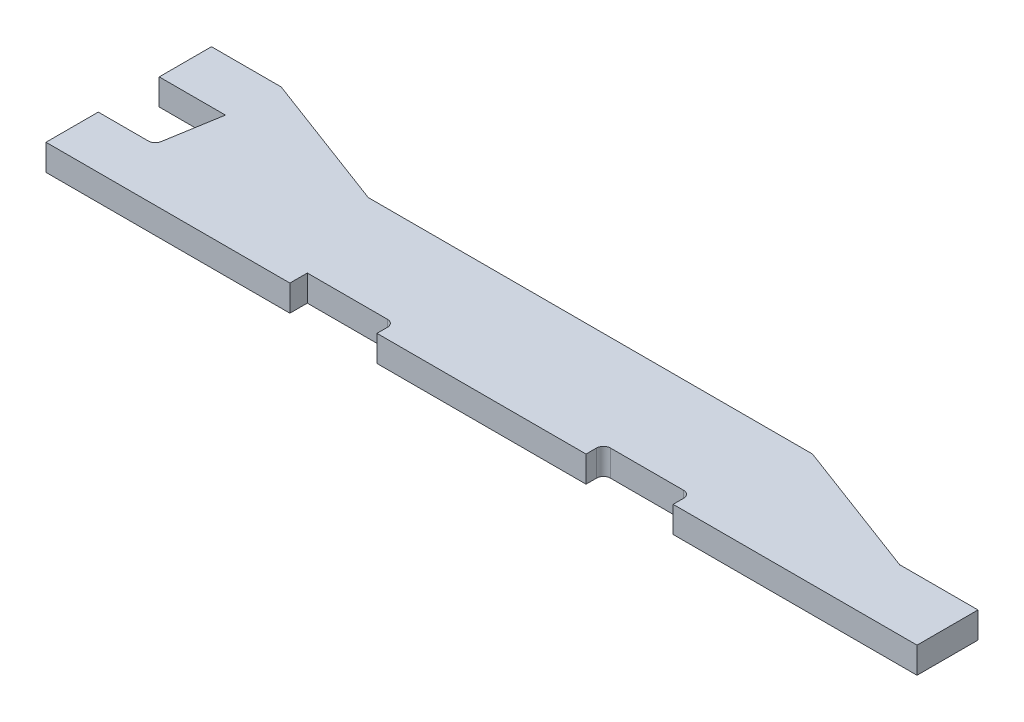
ISO-10303-21;
HEADER;
FILE_DESCRIPTION(('STEP AP214'),'2;1');
FILE_NAME('part.step','',(''),(''),'','','');
FILE_SCHEMA(('AUTOMOTIVE_DESIGN { 1 0 10303 214 1 1 1 1 }'));
ENDSEC;
DATA;
#1=APPLICATION_CONTEXT('core data for automotive mechanical design processes');
#2=APPLICATION_PROTOCOL_DEFINITION('international standard','automotive_design',2000,#1);
#3=PRODUCT_CONTEXT('',#1,'mechanical');
#4=PRODUCT('Part','Part','',(#3));
#5=PRODUCT_RELATED_PRODUCT_CATEGORY('part','',(#4));
#6=PRODUCT_DEFINITION_FORMATION('','',#4);
#7=PRODUCT_DEFINITION_CONTEXT('part definition',#1,'design');
#8=PRODUCT_DEFINITION('design','',#6,#7);
#9=PRODUCT_DEFINITION_SHAPE('','',#8);
#10=(LENGTH_UNIT() NAMED_UNIT(*) SI_UNIT(.MILLI.,.METRE.));
#11=(NAMED_UNIT(*) PLANE_ANGLE_UNIT() SI_UNIT($,.RADIAN.));
#12=(NAMED_UNIT(*) SI_UNIT($,.STERADIAN.) SOLID_ANGLE_UNIT());
#13=UNCERTAINTY_MEASURE_WITH_UNIT(LENGTH_MEASURE(1.E-05),#10,'distance_accuracy_value','');
#14=(GEOMETRIC_REPRESENTATION_CONTEXT(3) GLOBAL_UNCERTAINTY_ASSIGNED_CONTEXT((#13)) GLOBAL_UNIT_ASSIGNED_CONTEXT((#10,
#11,#12)) REPRESENTATION_CONTEXT('',''));
#15=CARTESIAN_POINT('',(0.,0.,0.));
#16=DIRECTION('',(0.,0.,1.));
#17=DIRECTION('',(1.,0.,0.));
#18=AXIS2_PLACEMENT_3D('',#15,#16,#17);
#19=CARTESIAN_POINT('',(-250.,-7.5,0.));
#20=DIRECTION('',(0.,0.,1.));
#21=DIRECTION('',(1.,0.,0.));
#22=AXIS2_PLACEMENT_3D('',#19,#20,#21);
#23=PLANE('',#22);
#24=DIRECTION('',(0.,1.,0.));
#25=VECTOR('',#24,1.);
#26=CARTESIAN_POINT('',(-110.,-7.50005000000005,0.));
#27=LINE('',#26,#25);
#28=CARTESIAN_POINT('',(-110.,-7.5,0.));
#29=VERTEX_POINT('',#28);
#30=CARTESIAN_POINT('',(-110.,7.49999999999999,0.));
#31=VERTEX_POINT('',#30);
#32=EDGE_CURVE('E326',#29,#31,#27,.T.);
#33=ORIENTED_EDGE('',*,*,#32,.T.);
#34=DIRECTION('',(-1.,0.,0.));
#35=VECTOR('',#34,1.);
#36=CARTESIAN_POINT('',(-250.,7.5,0.));
#37=LINE('',#36,#35);
#38=CARTESIAN_POINT('',(-250.,7.5,0.));
#39=VERTEX_POINT('',#38);
#40=EDGE_CURVE('E212',#31,#39,#37,.T.);
#41=ORIENTED_EDGE('',*,*,#40,.T.);
#42=DIRECTION('',(0.,-1.,0.));
#43=VECTOR('',#42,1.);
#44=CARTESIAN_POINT('',(-250.,7.5,0.));
#45=LINE('',#44,#43);
#46=CARTESIAN_POINT('',(-250.,-7.5,0.));
#47=VERTEX_POINT('',#46);
#48=EDGE_CURVE('E242',#39,#47,#45,.T.);
#49=ORIENTED_EDGE('',*,*,#48,.T.);
#50=DIRECTION('',(1.,0.,0.));
#51=VECTOR('',#50,1.);
#52=CARTESIAN_POINT('',(-250.,-7.5,0.));
#53=LINE('',#52,#51);
#54=EDGE_CURVE('E253',#47,#29,#53,.T.);
#55=ORIENTED_EDGE('',*,*,#54,.T.);
#56=EDGE_LOOP('',(#33,#41,#49,#55));
#57=FACE_BOUND('',#56,.T.);
#58=ADVANCED_FACE('F26',(#57),#23,.T.);
#59=DIRECTION('',(0.,1.,0.));
#60=VECTOR('',#59,1.);
#61=CARTESIAN_POINT('',(-60.,-7.50005000000005,0.));
#62=LINE('',#61,#60);
#63=CARTESIAN_POINT('',(-60.,-7.5,0.));
#64=VERTEX_POINT('',#63);
#65=CARTESIAN_POINT('',(-60.,7.49999999999999,0.));
#66=VERTEX_POINT('',#65);
#67=EDGE_CURVE('E185',#64,#66,#62,.T.);
#68=ORIENTED_EDGE('',*,*,#67,.F.);
#69=CARTESIAN_POINT('',(60.,-7.5,0.));
#70=VERTEX_POINT('',#69);
#71=EDGE_CURVE('E255',#64,#70,#53,.T.);
#72=ORIENTED_EDGE('',*,*,#71,.T.);
#73=DIRECTION('',(0.,-1.,0.));
#74=VECTOR('',#73,1.);
#75=CARTESIAN_POINT('',(60.,-7.49999999999996,0.));
#76=LINE('',#75,#74);
#77=CARTESIAN_POINT('',(60.,7.50000000000001,0.));
#78=VERTEX_POINT('',#77);
#79=EDGE_CURVE('E210',#78,#70,#76,.T.);
#80=ORIENTED_EDGE('',*,*,#79,.F.);
#81=EDGE_CURVE('E202',#78,#66,#37,.T.);
#82=ORIENTED_EDGE('',*,*,#81,.T.);
#83=EDGE_LOOP('',(#68,#72,#80,#82));
#84=FACE_BOUND('',#83,.T.);
#85=ADVANCED_FACE('F208',(#84),#23,.T.);
#86=CARTESIAN_POINT('',(-250.,7.5,-65.));
#87=DIRECTION('',(-1.,0.,0.));
#88=DIRECTION('',(0.,0.,1.));
#89=AXIS2_PLACEMENT_3D('',#86,#87,#88);
#90=PLANE('',#89);
#91=DIRECTION('',(0.,1.,0.));
#92=VECTOR('',#91,1.);
#93=CARTESIAN_POINT('',(-250.,-59.162365412358,-30.));
#94=LINE('',#93,#92);
#95=CARTESIAN_POINT('',(-250.,-7.5,-30.));
#96=VERTEX_POINT('',#95);
#97=CARTESIAN_POINT('',(-250.,7.49999999999997,-30.));
#98=VERTEX_POINT('',#97);
#99=EDGE_CURVE('E235',#96,#98,#94,.T.);
#100=ORIENTED_EDGE('',*,*,#99,.F.);
#101=DIRECTION('',(0.,0.,1.));
#102=VECTOR('',#101,1.);
#103=CARTESIAN_POINT('',(-250.,-7.5,-65.));
#104=LINE('',#103,#102);
#105=EDGE_CURVE('E417',#96,#47,#104,.T.);
#106=ORIENTED_EDGE('',*,*,#105,.T.);
#107=ORIENTED_EDGE('',*,*,#48,.F.);
#108=DIRECTION('',(0.,0.,1.));
#109=VECTOR('',#108,1.);
#110=CARTESIAN_POINT('',(-250.,7.5,-65.));
#111=LINE('',#110,#109);
#112=EDGE_CURVE('E282',#98,#39,#111,.T.);
#113=ORIENTED_EDGE('',*,*,#112,.F.);
#114=EDGE_LOOP('',(#100,#106,#107,#113));
#115=FACE_BOUND('',#114,.T.);
#116=ADVANCED_FACE('F422',(#115),#90,.T.);
#117=DIRECTION('',(0.,1.,0.));
#118=VECTOR('',#117,1.);
#119=CARTESIAN_POINT('',(-250.,-59.162365412358,-65.));
#120=LINE('',#119,#118);
#121=CARTESIAN_POINT('',(-250.,-7.5,-65.));
#122=VERTEX_POINT('',#121);
#123=CARTESIAN_POINT('',(-250.,7.49999999999997,-65.));
#124=VERTEX_POINT('',#123);
#125=EDGE_CURVE('E380',#122,#124,#120,.T.);
#126=ORIENTED_EDGE('',*,*,#125,.T.);
#127=CARTESIAN_POINT('',(-250.,7.49999999999997,-95.));
#128=VERTEX_POINT('',#127);
#129=EDGE_CURVE('E285',#128,#124,#111,.T.);
#130=ORIENTED_EDGE('',*,*,#129,.F.);
#131=DIRECTION('',(0.,1.,0.));
#132=VECTOR('',#131,1.);
#133=CARTESIAN_POINT('',(-250.,-131.19316876853,-95.));
#134=LINE('',#133,#132);
#135=CARTESIAN_POINT('',(-250.,-7.50000000000001,-95.));
#136=VERTEX_POINT('',#135);
#137=EDGE_CURVE('E243',#136,#128,#134,.T.);
#138=ORIENTED_EDGE('',*,*,#137,.F.);
#139=EDGE_CURVE('E229',#136,#122,#104,.T.);
#140=ORIENTED_EDGE('',*,*,#139,.T.);
#141=EDGE_LOOP('',(#126,#130,#138,#140));
#142=FACE_BOUND('',#141,.T.);
#143=ADVANCED_FACE('F28',(#142),#90,.T.);
#144=CARTESIAN_POINT('',(-250.,7.5,-65.));
#145=DIRECTION('',(0.,1.,0.));
#146=DIRECTION('',(0.,0.,1.));
#147=AXIS2_PLACEMENT_3D('',#144,#145,#146);
#148=PLANE('',#147);
#149=DIRECTION('',(0.,0.,1.));
#150=VECTOR('',#149,1.);
#151=CARTESIAN_POINT('',(-110.,7.49999999999999,0.));
#152=LINE('',#151,#150);
#153=CARTESIAN_POINT('',(-110.,7.49999999999999,-10.));
#154=VERTEX_POINT('',#153);
#155=EDGE_CURVE('E195',#154,#31,#152,.T.);
#156=ORIENTED_EDGE('',*,*,#155,.F.);
#157=DIRECTION('',(-1.,0.,0.));
#158=VECTOR('',#157,1.);
#159=CARTESIAN_POINT('',(-64.,7.49999999999999,-10.));
#160=LINE('',#159,#158);
#161=CARTESIAN_POINT('',(-64.,7.49999999999999,-10.));
#162=VERTEX_POINT('',#161);
#163=EDGE_CURVE('E616',#162,#154,#160,.T.);
#164=ORIENTED_EDGE('',*,*,#163,.F.);
#165=CARTESIAN_POINT('',(-64.,7.49999999999999,-6.));
#166=DIRECTION('',(0.,1.,0.));
#167=DIRECTION('',(-1.,0.,0.));
#168=AXIS2_PLACEMENT_3D('',#165,#166,#167);
#169=CIRCLE('',#168,4.);
#170=CARTESIAN_POINT('',(-60.,7.49999999999999,-5.99999999999997));
#171=VERTEX_POINT('',#170);
#172=EDGE_CURVE('E205',#171,#162,#169,.T.);
#173=ORIENTED_EDGE('',*,*,#172,.F.);
#174=DIRECTION('',(0.,0.,-1.));
#175=VECTOR('',#174,1.);
#176=CARTESIAN_POINT('',(-60.,7.49999999999999,0.));
#177=LINE('',#176,#175);
#178=EDGE_CURVE('E188',#66,#171,#177,.T.);
#179=ORIENTED_EDGE('',*,*,#178,.F.);
#180=ORIENTED_EDGE('',*,*,#81,.F.);
#181=DIRECTION('',(0.,0.,1.));
#182=VECTOR('',#181,1.);
#183=CARTESIAN_POINT('',(60.,7.50000000000001,0.));
#184=LINE('',#183,#182);
#185=CARTESIAN_POINT('',(60.,7.50000000000001,-5.99999999999997));
#186=VERTEX_POINT('',#185);
#187=EDGE_CURVE('E321',#186,#78,#184,.T.);
#188=ORIENTED_EDGE('',*,*,#187,.F.);
#189=CARTESIAN_POINT('',(64.,7.50000000000001,-6.));
#190=DIRECTION('',(0.,1.,0.));
#191=DIRECTION('',(-1.,0.,0.));
#192=AXIS2_PLACEMENT_3D('',#189,#190,#191);
#193=CIRCLE('',#192,4.);
#194=CARTESIAN_POINT('',(64.,7.50000000000001,-10.));
#195=VERTEX_POINT('',#194);
#196=EDGE_CURVE('E338',#195,#186,#193,.T.);
#197=ORIENTED_EDGE('',*,*,#196,.F.);
#198=DIRECTION('',(-1.,0.,0.));
#199=VECTOR('',#198,1.);
#200=CARTESIAN_POINT('',(64.,7.50000000000001,-10.));
#201=LINE('',#200,#199);
#202=CARTESIAN_POINT('',(106.,7.50000000000001,-10.));
#203=VERTEX_POINT('',#202);
#204=EDGE_CURVE('E335',#203,#195,#201,.T.);
#205=ORIENTED_EDGE('',*,*,#204,.F.);
#206=CARTESIAN_POINT('',(106.,7.50000000000001,-6.00000000000001));
#207=DIRECTION('',(0.,1.,0.));
#208=DIRECTION('',(-1.,0.,0.));
#209=AXIS2_PLACEMENT_3D('',#206,#207,#208);
#210=CIRCLE('',#209,4.);
#211=CARTESIAN_POINT('',(110.,7.50000000000001,-5.99999999999998));
#212=VERTEX_POINT('',#211);
#213=EDGE_CURVE('E328',#212,#203,#210,.T.);
#214=ORIENTED_EDGE('',*,*,#213,.F.);
#215=DIRECTION('',(0.,0.,-1.));
#216=VECTOR('',#215,1.);
#217=CARTESIAN_POINT('',(110.,7.50000000000001,0.));
#218=LINE('',#217,#216);
#219=CARTESIAN_POINT('',(110.,7.50000000000001,0.));
#220=VERTEX_POINT('',#219);
#221=EDGE_CURVE('E325',#220,#212,#218,.T.);
#222=ORIENTED_EDGE('',*,*,#221,.F.);
#223=CARTESIAN_POINT('',(250.,7.5,0.));
#224=VERTEX_POINT('',#223);
#225=EDGE_CURVE('E211',#224,#220,#37,.T.);
#226=ORIENTED_EDGE('',*,*,#225,.F.);
#227=DIRECTION('',(0.,0.,1.));
#228=VECTOR('',#227,1.);
#229=CARTESIAN_POINT('',(250.,7.5,-65.));
#230=LINE('',#229,#228);
#231=CARTESIAN_POINT('',(250.,7.50000000000003,-35.));
#232=VERTEX_POINT('',#231);
#233=EDGE_CURVE('E277',#232,#224,#230,.T.);
#234=ORIENTED_EDGE('',*,*,#233,.F.);
#235=DIRECTION('',(1.,0.,0.));
#236=VECTOR('',#235,1.);
#237=CARTESIAN_POINT('',(250.,7.50000000000003,-35.));
#238=LINE('',#237,#236);
#239=CARTESIAN_POINT('',(205.,7.50000000000002,-35.));
#240=VERTEX_POINT('',#239);
#241=EDGE_CURVE('E350',#240,#232,#238,.T.);
#242=ORIENTED_EDGE('',*,*,#241,.F.);
#243=DIRECTION('',(0.936329177569045,0.,0.351123441588392));
#244=VECTOR('',#243,1.);
#245=CARTESIAN_POINT('',(205.,7.50000000000002,-35.));
#246=LINE('',#245,#244);
#247=CARTESIAN_POINT('',(125.,7.50000000000001,-65.));
#248=VERTEX_POINT('',#247);
#249=EDGE_CURVE('E349',#248,#240,#246,.T.);
#250=ORIENTED_EDGE('',*,*,#249,.F.);
#251=DIRECTION('',(-1.,0.,0.));
#252=VECTOR('',#251,1.);
#253=CARTESIAN_POINT('',(-250.,7.5,-65.));
#254=LINE('',#253,#252);
#255=CARTESIAN_POINT('',(-130.,7.5,-65.));
#256=VERTEX_POINT('',#255);
#257=EDGE_CURVE('E228',#248,#256,#254,.T.);
#258=ORIENTED_EDGE('',*,*,#257,.T.);
#259=DIRECTION('',(-0.936329177569044,0.,-0.351123441588392));
#260=VECTOR('',#259,1.);
#261=CARTESIAN_POINT('',(-210.,7.49999999999998,-95.));
#262=LINE('',#261,#260);
#263=CARTESIAN_POINT('',(-210.,7.49999999999998,-95.));
#264=VERTEX_POINT('',#263);
#265=EDGE_CURVE('E231',#256,#264,#262,.T.);
#266=ORIENTED_EDGE('',*,*,#265,.T.);
#267=DIRECTION('',(-1.,0.,0.));
#268=VECTOR('',#267,1.);
#269=CARTESIAN_POINT('',(-250.,7.49999999999997,-95.));
#270=LINE('',#269,#268);
#271=EDGE_CURVE('E234',#264,#128,#270,.T.);
#272=ORIENTED_EDGE('',*,*,#271,.T.);
#273=ORIENTED_EDGE('',*,*,#129,.T.);
#274=DIRECTION('',(-1.,0.,0.));
#275=VECTOR('',#274,1.);
#276=CARTESIAN_POINT('',(-250.,7.49999999999997,-65.));
#277=LINE('',#276,#275);
#278=CARTESIAN_POINT('',(-212.,7.49999999999998,-65.));
#279=VERTEX_POINT('',#278);
#280=EDGE_CURVE('E363',#279,#124,#277,.T.);
#281=ORIENTED_EDGE('',*,*,#280,.F.);
#282=DIRECTION('',(0.165047605860675,0.,-0.986285601537232));
#283=VECTOR('',#282,1.);
#284=CARTESIAN_POINT('',(-217.298098869473,7.49999999999998,-33.3398095765573));
#285=LINE('',#284,#283);
#286=CARTESIAN_POINT('',(-217.298098869473,7.49999999999998,-33.3398095765573));
#287=VERTEX_POINT('',#286);
#288=EDGE_CURVE('E366',#287,#279,#285,.T.);
#289=ORIENTED_EDGE('',*,*,#288,.F.);
#290=CARTESIAN_POINT('',(-221.243241275622,7.49999999999998,-34.));
#291=DIRECTION('',(0.,1.,0.));
#292=DIRECTION('',(1.,0.,0.));
#293=AXIS2_PLACEMENT_3D('',#290,#291,#292);
#294=CIRCLE('',#293,3.99999999999999);
#295=CARTESIAN_POINT('',(-221.243241275622,7.49999999999998,-30.));
#296=VERTEX_POINT('',#295);
#297=EDGE_CURVE('E369',#296,#287,#294,.T.);
#298=ORIENTED_EDGE('',*,*,#297,.F.);
#299=DIRECTION('',(1.,0.,0.));
#300=VECTOR('',#299,1.);
#301=CARTESIAN_POINT('',(-250.,7.49999999999997,-30.));
#302=LINE('',#301,#300);
#303=EDGE_CURVE('E360',#98,#296,#302,.T.);
#304=ORIENTED_EDGE('',*,*,#303,.F.);
#305=ORIENTED_EDGE('',*,*,#112,.T.);
#306=ORIENTED_EDGE('',*,*,#40,.F.);
#307=EDGE_LOOP('',(#156,#164,#173,#179,#180,#188,#197,#205,#214,#222,#226,#234,#242,#250,#258,
#266,#272,#273,#281,#289,#298,#304,#305,#306));
#308=FACE_BOUND('',#307,.T.);
#309=ADVANCED_FACE('F200',(#308),#148,.T.);
#310=CARTESIAN_POINT('',(250.,7.5,-65.));
#311=DIRECTION('',(1.,0.,0.));
#312=DIRECTION('',(0.,0.,-1.));
#313=AXIS2_PLACEMENT_3D('',#310,#311,#312);
#314=PLANE('',#313);
#315=DIRECTION('',(0.,1.,0.));
#316=VECTOR('',#315,1.);
#317=CARTESIAN_POINT('',(250.,-136.049601321824,-35.));
#318=LINE('',#317,#316);
#319=CARTESIAN_POINT('',(250.,-7.50000000000001,-35.));
#320=VERTEX_POINT('',#319);
#321=EDGE_CURVE('E280',#320,#232,#318,.T.);
#322=ORIENTED_EDGE('',*,*,#321,.T.);
#323=ORIENTED_EDGE('',*,*,#233,.T.);
#324=DIRECTION('',(0.,1.,0.));
#325=VECTOR('',#324,1.);
#326=CARTESIAN_POINT('',(250.,7.5,0.));
#327=LINE('',#326,#325);
#328=CARTESIAN_POINT('',(250.,-7.5,0.));
#329=VERTEX_POINT('',#328);
#330=EDGE_CURVE('E216',#329,#224,#327,.T.);
#331=ORIENTED_EDGE('',*,*,#330,.F.);
#332=DIRECTION('',(0.,0.,1.));
#333=VECTOR('',#332,1.);
#334=CARTESIAN_POINT('',(250.,-7.5,-65.));
#335=LINE('',#334,#333);
#336=EDGE_CURVE('E270',#320,#329,#335,.T.);
#337=ORIENTED_EDGE('',*,*,#336,.F.);
#338=EDGE_LOOP('',(#322,#323,#331,#337));
#339=FACE_BOUND('',#338,.T.);
#340=ADVANCED_FACE('F278',(#339),#314,.T.);
#341=CARTESIAN_POINT('',(-250.,-7.5,-65.));
#342=DIRECTION('',(0.,-1.,0.));
#343=DIRECTION('',(0.,0.,-1.));
#344=AXIS2_PLACEMENT_3D('',#341,#342,#343);
#345=PLANE('',#344);
#346=DIRECTION('',(0.,0.,-1.));
#347=VECTOR('',#346,1.);
#348=CARTESIAN_POINT('',(-110.,-7.5,-65.));
#349=LINE('',#348,#347);
#350=CARTESIAN_POINT('',(-110.,-7.5,-10.));
#351=VERTEX_POINT('',#350);
#352=EDGE_CURVE('E11',#29,#351,#349,.T.);
#353=ORIENTED_EDGE('',*,*,#352,.F.);
#354=ORIENTED_EDGE('',*,*,#54,.F.);
#355=ORIENTED_EDGE('',*,*,#105,.F.);
#356=DIRECTION('',(1.,0.,0.));
#357=VECTOR('',#356,1.);
#358=CARTESIAN_POINT('',(-250.,-7.5,-30.));
#359=LINE('',#358,#357);
#360=CARTESIAN_POINT('',(-221.243241275622,-7.5,-30.));
#361=VERTEX_POINT('',#360);
#362=EDGE_CURVE('E365',#96,#361,#359,.T.);
#363=ORIENTED_EDGE('',*,*,#362,.T.);
#364=CARTESIAN_POINT('',(-221.243241275622,-7.5,-34.));
#365=DIRECTION('',(0.,-1.,0.));
#366=DIRECTION('',(0.,0.,-1.));
#367=AXIS2_PLACEMENT_3D('',#364,#365,#366);
#368=CIRCLE('',#367,3.99999999999999);
#369=CARTESIAN_POINT('',(-217.298098869473,-7.5,-33.3398095765573));
#370=VERTEX_POINT('',#369);
#371=EDGE_CURVE('E386',#361,#370,#368,.F.);
#372=ORIENTED_EDGE('',*,*,#371,.T.);
#373=DIRECTION('',(0.165047605860675,0.,-0.986285601537232));
#374=VECTOR('',#373,1.);
#375=CARTESIAN_POINT('',(-217.298098869473,-7.5,-33.3398095765573));
#376=LINE('',#375,#374);
#377=CARTESIAN_POINT('',(-212.,-7.5,-65.));
#378=VERTEX_POINT('',#377);
#379=EDGE_CURVE('E382',#370,#378,#376,.T.);
#380=ORIENTED_EDGE('',*,*,#379,.T.);
#381=DIRECTION('',(-1.,0.,0.));
#382=VECTOR('',#381,1.);
#383=CARTESIAN_POINT('',(-250.,-7.5,-65.));
#384=LINE('',#383,#382);
#385=EDGE_CURVE('E377',#378,#122,#384,.T.);
#386=ORIENTED_EDGE('',*,*,#385,.T.);
#387=ORIENTED_EDGE('',*,*,#139,.F.);
#388=DIRECTION('',(-1.,0.,0.));
#389=VECTOR('',#388,1.);
#390=CARTESIAN_POINT('',(-250.,-7.50000000000001,-95.));
#391=LINE('',#390,#389);
#392=CARTESIAN_POINT('',(-210.,-7.50000000000001,-95.));
#393=VERTEX_POINT('',#392);
#394=EDGE_CURVE('E396',#393,#136,#391,.T.);
#395=ORIENTED_EDGE('',*,*,#394,.F.);
#396=DIRECTION('',(-0.936329177569045,0.,-0.351123441588392));
#397=VECTOR('',#396,1.);
#398=CARTESIAN_POINT('',(-210.,-7.50000000000001,-95.));
#399=LINE('',#398,#397);
#400=CARTESIAN_POINT('',(-130.,-7.50000000000001,-65.));
#401=VERTEX_POINT('',#400);
#402=EDGE_CURVE('E244',#401,#393,#399,.T.);
#403=ORIENTED_EDGE('',*,*,#402,.F.);
#404=DIRECTION('',(1.,0.,0.));
#405=VECTOR('',#404,1.);
#406=CARTESIAN_POINT('',(-250.,-7.5,-65.));
#407=LINE('',#406,#405);
#408=CARTESIAN_POINT('',(125.,-7.5,-65.));
#409=VERTEX_POINT('',#408);
#410=EDGE_CURVE('E215',#401,#409,#407,.T.);
#411=ORIENTED_EDGE('',*,*,#410,.T.);
#412=DIRECTION('',(0.936329177569045,0.,0.351123441588392));
#413=VECTOR('',#412,1.);
#414=CARTESIAN_POINT('',(205.,-7.50000000000001,-35.));
#415=LINE('',#414,#413);
#416=CARTESIAN_POINT('',(205.,-7.50000000000001,-35.));
#417=VERTEX_POINT('',#416);
#418=EDGE_CURVE('E357',#409,#417,#415,.T.);
#419=ORIENTED_EDGE('',*,*,#418,.T.);
#420=DIRECTION('',(1.,0.,0.));
#421=VECTOR('',#420,1.);
#422=CARTESIAN_POINT('',(250.,-7.50000000000001,-35.));
#423=LINE('',#422,#421);
#424=EDGE_CURVE('E274',#417,#320,#423,.T.);
#425=ORIENTED_EDGE('',*,*,#424,.T.);
#426=ORIENTED_EDGE('',*,*,#336,.T.);
#427=CARTESIAN_POINT('',(110.,-7.5,0.));
#428=VERTEX_POINT('',#427);
#429=EDGE_CURVE('E252',#428,#329,#53,.T.);
#430=ORIENTED_EDGE('',*,*,#429,.F.);
#431=DIRECTION('',(0.,0.,1.));
#432=VECTOR('',#431,1.);
#433=CARTESIAN_POINT('',(110.,-7.5,-65.));
#434=LINE('',#433,#432);
#435=CARTESIAN_POINT('',(110.,-7.5,-5.99999999999998));
#436=VERTEX_POINT('',#435);
#437=EDGE_CURVE('E49',#436,#428,#434,.T.);
#438=ORIENTED_EDGE('',*,*,#437,.F.);
#439=CARTESIAN_POINT('',(106.,-7.5,-6.00000000000001));
#440=DIRECTION('',(0.,-1.,0.));
#441=DIRECTION('',(0.,0.,-1.));
#442=AXIS2_PLACEMENT_3D('',#439,#440,#441);
#443=CIRCLE('',#442,4.);
#444=CARTESIAN_POINT('',(106.,-7.5,-10.));
#445=VERTEX_POINT('',#444);
#446=EDGE_CURVE('E292',#445,#436,#443,.T.);
#447=ORIENTED_EDGE('',*,*,#446,.F.);
#448=DIRECTION('',(1.,0.,0.));
#449=VECTOR('',#448,1.);
#450=CARTESIAN_POINT('',(-250.,-7.5,-9.99999999999995));
#451=LINE('',#450,#449);
#452=CARTESIAN_POINT('',(64.,-7.5,-10.));
#453=VERTEX_POINT('',#452);
#454=EDGE_CURVE('E297',#453,#445,#451,.T.);
#455=ORIENTED_EDGE('',*,*,#454,.F.);
#456=CARTESIAN_POINT('',(64.,-7.5,-6.));
#457=DIRECTION('',(0.,-1.,0.));
#458=DIRECTION('',(0.,0.,-1.));
#459=AXIS2_PLACEMENT_3D('',#456,#457,#458);
#460=CIRCLE('',#459,4.);
#461=CARTESIAN_POINT('',(60.,-7.5,-5.99999999999997));
#462=VERTEX_POINT('',#461);
#463=EDGE_CURVE('E299',#462,#453,#460,.T.);
#464=ORIENTED_EDGE('',*,*,#463,.F.);
#465=DIRECTION('',(0.,0.,-1.));
#466=VECTOR('',#465,1.);
#467=CARTESIAN_POINT('',(60.,-7.5,-65.));
#468=LINE('',#467,#466);
#469=EDGE_CURVE('E317',#70,#462,#468,.T.);
#470=ORIENTED_EDGE('',*,*,#469,.F.);
#471=ORIENTED_EDGE('',*,*,#71,.F.);
#472=DIRECTION('',(0.,0.,1.));
#473=VECTOR('',#472,1.);
#474=CARTESIAN_POINT('',(-60.,-7.5,-65.));
#475=LINE('',#474,#473);
#476=CARTESIAN_POINT('',(-60.,-7.5,-5.99999999999997));
#477=VERTEX_POINT('',#476);
#478=EDGE_CURVE('E191',#477,#64,#475,.T.);
#479=ORIENTED_EDGE('',*,*,#478,.F.);
#480=CARTESIAN_POINT('',(-64.,-7.5,-6.));
#481=DIRECTION('',(0.,-1.,0.));
#482=DIRECTION('',(0.,0.,-1.));
#483=AXIS2_PLACEMENT_3D('',#480,#481,#482);
#484=CIRCLE('',#483,4.);
#485=CARTESIAN_POINT('',(-64.,-7.5,-10.));
#486=VERTEX_POINT('',#485);
#487=EDGE_CURVE('E302',#486,#477,#484,.T.);
#488=ORIENTED_EDGE('',*,*,#487,.F.);
#489=DIRECTION('',(1.,0.,0.));
#490=VECTOR('',#489,1.);
#491=CARTESIAN_POINT('',(-250.,-7.5,-10.));
#492=LINE('',#491,#490);
#493=EDGE_CURVE('E34',#351,#486,#492,.T.);
#494=ORIENTED_EDGE('',*,*,#493,.F.);
#495=EDGE_LOOP('',(#353,#354,#355,#363,#372,#380,#386,#387,#395,#403,#411,#419,#425,#426,#430,
#438,#447,#455,#464,#470,#471,#479,#488,#494));
#496=FACE_BOUND('',#495,.T.);
#497=ADVANCED_FACE('F272',(#496),#345,.T.);
#498=CARTESIAN_POINT('',(-250.,-7.5,-65.));
#499=DIRECTION('',(0.,0.,1.));
#500=DIRECTION('',(1.,0.,0.));
#501=AXIS2_PLACEMENT_3D('',#498,#499,#500);
#502=PLANE('',#501);
#503=ORIENTED_EDGE('',*,*,#257,.F.);
#504=DIRECTION('',(0.,1.,0.));
#505=VECTOR('',#504,1.);
#506=CARTESIAN_POINT('',(125.,-136.049601321824,-65.));
#507=LINE('',#506,#505);
#508=EDGE_CURVE('E352',#409,#248,#507,.T.);
#509=ORIENTED_EDGE('',*,*,#508,.F.);
#510=ORIENTED_EDGE('',*,*,#410,.F.);
#511=DIRECTION('',(0.,1.,0.));
#512=VECTOR('',#511,1.);
#513=CARTESIAN_POINT('',(-130.,-131.19316876853,-65.));
#514=LINE('',#513,#512);
#515=EDGE_CURVE('E238',#401,#256,#514,.T.);
#516=ORIENTED_EDGE('',*,*,#515,.T.);
#517=EDGE_LOOP('',(#503,#509,#510,#516));
#518=FACE_BOUND('',#517,.T.);
#519=ADVANCED_FACE('F415',(#518),#502,.F.);
#520=DIRECTION('',(0.,1.,0.));
#521=VECTOR('',#520,1.);
#522=CARTESIAN_POINT('',(110.,-7.49999999999996,0.));
#523=LINE('',#522,#521);
#524=EDGE_CURVE('E266',#428,#220,#523,.T.);
#525=ORIENTED_EDGE('',*,*,#524,.F.);
#526=ORIENTED_EDGE('',*,*,#429,.T.);
#527=ORIENTED_EDGE('',*,*,#330,.T.);
#528=ORIENTED_EDGE('',*,*,#225,.T.);
#529=EDGE_LOOP('',(#525,#526,#527,#528));
#530=FACE_BOUND('',#529,.T.);
#531=ADVANCED_FACE('F263',(#530),#23,.T.);
#532=CARTESIAN_POINT('',(-210.,-131.19316876853,-95.));
#533=DIRECTION('',(0.351123441588392,0.,-0.936329177569045));
#534=DIRECTION('',(-0.936329177569045,0.,-0.351123441588392));
#535=AXIS2_PLACEMENT_3D('',#532,#533,#534);
#536=PLANE('',#535);
#537=ORIENTED_EDGE('',*,*,#515,.F.);
#538=ORIENTED_EDGE('',*,*,#402,.T.);
#539=DIRECTION('',(0.,1.,0.));
#540=VECTOR('',#539,1.);
#541=CARTESIAN_POINT('',(-210.,-131.19316876853,-95.));
#542=LINE('',#541,#540);
#543=EDGE_CURVE('E249',#393,#264,#542,.T.);
#544=ORIENTED_EDGE('',*,*,#543,.T.);
#545=ORIENTED_EDGE('',*,*,#265,.F.);
#546=EDGE_LOOP('',(#537,#538,#544,#545));
#547=FACE_BOUND('',#546,.T.);
#548=ADVANCED_FACE('F411',(#547),#536,.T.);
#549=CARTESIAN_POINT('',(-250.,-131.19316876853,-95.));
#550=DIRECTION('',(0.,0.,-1.));
#551=DIRECTION('',(-1.,0.,0.));
#552=AXIS2_PLACEMENT_3D('',#549,#550,#551);
#553=PLANE('',#552);
#554=ORIENTED_EDGE('',*,*,#543,.F.);
#555=ORIENTED_EDGE('',*,*,#394,.T.);
#556=ORIENTED_EDGE('',*,*,#137,.T.);
#557=ORIENTED_EDGE('',*,*,#271,.F.);
#558=EDGE_LOOP('',(#554,#555,#556,#557));
#559=FACE_BOUND('',#558,.T.);
#560=ADVANCED_FACE('F403',(#559),#553,.T.);
#561=CARTESIAN_POINT('',(-250.,-59.162365412358,-30.));
#562=DIRECTION('',(0.,0.,1.));
#563=DIRECTION('',(1.,0.,0.));
#564=AXIS2_PLACEMENT_3D('',#561,#562,#563);
#565=PLANE('',#564);
#566=ORIENTED_EDGE('',*,*,#99,.T.);
#567=ORIENTED_EDGE('',*,*,#303,.T.);
#568=DIRECTION('',(0.,1.,0.));
#569=VECTOR('',#568,1.);
#570=CARTESIAN_POINT('',(-221.243241275622,-59.162365412358,-30.));
#571=LINE('',#570,#569);
#572=EDGE_CURVE('E376',#361,#296,#571,.T.);
#573=ORIENTED_EDGE('',*,*,#572,.F.);
#574=ORIENTED_EDGE('',*,*,#362,.F.);
#575=EDGE_LOOP('',(#566,#567,#573,#574));
#576=FACE_BOUND('',#575,.T.);
#577=ADVANCED_FACE('F430',(#576),#565,.F.);
#578=CARTESIAN_POINT('',(-221.243241275622,-59.162365412358,-34.));
#579=DIRECTION('',(0.,1.,0.));
#580=DIRECTION('',(-1.,0.,0.));
#581=AXIS2_PLACEMENT_3D('',#578,#579,#580);
#582=CYLINDRICAL_SURFACE('',#581,3.99999999999999);
#583=ORIENTED_EDGE('',*,*,#572,.T.);
#584=ORIENTED_EDGE('',*,*,#297,.T.);
#585=DIRECTION('',(0.,1.,0.));
#586=VECTOR('',#585,1.);
#587=CARTESIAN_POINT('',(-217.298098869473,-59.162365412358,-33.3398095765573));
#588=LINE('',#587,#586);
#589=EDGE_CURVE('E385',#370,#287,#588,.T.);
#590=ORIENTED_EDGE('',*,*,#589,.F.);
#591=ORIENTED_EDGE('',*,*,#371,.F.);
#592=EDGE_LOOP('',(#583,#584,#590,#591));
#593=FACE_BOUND('',#592,.T.);
#594=ADVANCED_FACE('F433',(#593),#582,.F.);
#595=CARTESIAN_POINT('',(-217.298098869473,-59.162365412358,-33.3398095765573));
#596=DIRECTION('',(0.986285601537232,0.,0.165047605860675));
#597=DIRECTION('',(0.165047605860675,0.,-0.986285601537232));
#598=AXIS2_PLACEMENT_3D('',#595,#596,#597);
#599=PLANE('',#598);
#600=ORIENTED_EDGE('',*,*,#589,.T.);
#601=ORIENTED_EDGE('',*,*,#288,.T.);
#602=DIRECTION('',(0.,1.,0.));
#603=VECTOR('',#602,1.);
#604=CARTESIAN_POINT('',(-212.,-59.162365412358,-65.));
#605=LINE('',#604,#603);
#606=EDGE_CURVE('E381',#378,#279,#605,.T.);
#607=ORIENTED_EDGE('',*,*,#606,.F.);
#608=ORIENTED_EDGE('',*,*,#379,.F.);
#609=EDGE_LOOP('',(#600,#601,#607,#608));
#610=FACE_BOUND('',#609,.T.);
#611=ADVANCED_FACE('F435',(#610),#599,.F.);
#612=CARTESIAN_POINT('',(-250.,-59.162365412358,-65.));
#613=DIRECTION('',(0.,0.,-1.));
#614=DIRECTION('',(-1.,0.,0.));
#615=AXIS2_PLACEMENT_3D('',#612,#613,#614);
#616=PLANE('',#615);
#617=ORIENTED_EDGE('',*,*,#606,.T.);
#618=ORIENTED_EDGE('',*,*,#280,.T.);
#619=ORIENTED_EDGE('',*,*,#125,.F.);
#620=ORIENTED_EDGE('',*,*,#385,.F.);
#621=EDGE_LOOP('',(#617,#618,#619,#620));
#622=FACE_BOUND('',#621,.T.);
#623=ADVANCED_FACE('F438',(#622),#616,.F.);
#624=CARTESIAN_POINT('',(205.,-136.049601321824,-35.));
#625=DIRECTION('',(-0.351123441588392,0.,0.936329177569044));
#626=DIRECTION('',(0.936329177569045,0.,0.351123441588392));
#627=AXIS2_PLACEMENT_3D('',#624,#625,#626);
#628=PLANE('',#627);
#629=ORIENTED_EDGE('',*,*,#508,.T.);
#630=ORIENTED_EDGE('',*,*,#249,.T.);
#631=DIRECTION('',(0.,1.,0.));
#632=VECTOR('',#631,1.);
#633=CARTESIAN_POINT('',(205.,-136.049601321824,-35.));
#634=LINE('',#633,#632);
#635=EDGE_CURVE('E356',#417,#240,#634,.T.);
#636=ORIENTED_EDGE('',*,*,#635,.F.);
#637=ORIENTED_EDGE('',*,*,#418,.F.);
#638=EDGE_LOOP('',(#629,#630,#636,#637));
#639=FACE_BOUND('',#638,.T.);
#640=ADVANCED_FACE('F476',(#639),#628,.F.);
#641=CARTESIAN_POINT('',(250.,-136.049601321824,-35.));
#642=DIRECTION('',(0.,0.,1.));
#643=DIRECTION('',(1.,0.,0.));
#644=AXIS2_PLACEMENT_3D('',#641,#642,#643);
#645=PLANE('',#644);
#646=ORIENTED_EDGE('',*,*,#635,.T.);
#647=ORIENTED_EDGE('',*,*,#241,.T.);
#648=ORIENTED_EDGE('',*,*,#321,.F.);
#649=ORIENTED_EDGE('',*,*,#424,.F.);
#650=EDGE_LOOP('',(#646,#647,#648,#649));
#651=FACE_BOUND('',#650,.T.);
#652=ADVANCED_FACE('F540',(#651),#645,.F.);
#653=CARTESIAN_POINT('',(60.,-7.50005000000003,0.));
#654=DIRECTION('',(-1.,0.,0.));
#655=DIRECTION('',(0.,-1.,0.));
#656=AXIS2_PLACEMENT_3D('',#653,#654,#655);
#657=PLANE('',#656);
#658=ORIENTED_EDGE('',*,*,#469,.T.);
#659=DIRECTION('',(0.,1.,0.));
#660=VECTOR('',#659,1.);
#661=CARTESIAN_POINT('',(60.,-7.50005000000003,-5.99999999999997));
#662=LINE('',#661,#660);
#663=EDGE_CURVE('E322',#462,#186,#662,.T.);
#664=ORIENTED_EDGE('',*,*,#663,.T.);
#665=ORIENTED_EDGE('',*,*,#187,.T.);
#666=ORIENTED_EDGE('',*,*,#79,.T.);
#667=EDGE_LOOP('',(#658,#664,#665,#666));
#668=FACE_BOUND('',#667,.T.);
#669=ADVANCED_FACE('F319',(#668),#657,.F.);
#670=CARTESIAN_POINT('',(64.,-7.50005000000003,-6.));
#671=DIRECTION('',(0.,1.,0.));
#672=DIRECTION('',(-1.,0.,0.));
#673=AXIS2_PLACEMENT_3D('',#670,#671,#672);
#674=CYLINDRICAL_SURFACE('',#673,4.);
#675=ORIENTED_EDGE('',*,*,#463,.T.);
#676=DIRECTION('',(0.,1.,0.));
#677=VECTOR('',#676,1.);
#678=CARTESIAN_POINT('',(64.,-7.50005000000003,-10.));
#679=LINE('',#678,#677);
#680=EDGE_CURVE('E342',#453,#195,#679,.T.);
#681=ORIENTED_EDGE('',*,*,#680,.T.);
#682=ORIENTED_EDGE('',*,*,#196,.T.);
#683=ORIENTED_EDGE('',*,*,#663,.F.);
#684=EDGE_LOOP('',(#675,#681,#682,#683));
#685=FACE_BOUND('',#684,.T.);
#686=ADVANCED_FACE('F549',(#685),#674,.F.);
#687=CARTESIAN_POINT('',(64.,-7.50005000000003,-10.));
#688=DIRECTION('',(0.,0.,-1.));
#689=DIRECTION('',(-1.,0.,0.));
#690=AXIS2_PLACEMENT_3D('',#687,#688,#689);
#691=PLANE('',#690);
#692=ORIENTED_EDGE('',*,*,#454,.T.);
#693=DIRECTION('',(0.,1.,0.));
#694=VECTOR('',#693,1.);
#695=CARTESIAN_POINT('',(106.,-7.50005000000002,-10.));
#696=LINE('',#695,#694);
#697=EDGE_CURVE('E344',#445,#203,#696,.T.);
#698=ORIENTED_EDGE('',*,*,#697,.T.);
#699=ORIENTED_EDGE('',*,*,#204,.T.);
#700=ORIENTED_EDGE('',*,*,#680,.F.);
#701=EDGE_LOOP('',(#692,#698,#699,#700));
#702=FACE_BOUND('',#701,.T.);
#703=ADVANCED_FACE('F556',(#702),#691,.F.);
#704=CARTESIAN_POINT('',(106.,-7.50005000000002,-6.00000000000001));
#705=DIRECTION('',(0.,1.,0.));
#706=DIRECTION('',(-1.,0.,0.));
#707=AXIS2_PLACEMENT_3D('',#704,#705,#706);
#708=CYLINDRICAL_SURFACE('',#707,4.);
#709=ORIENTED_EDGE('',*,*,#446,.T.);
#710=DIRECTION('',(0.,1.,0.));
#711=VECTOR('',#710,1.);
#712=CARTESIAN_POINT('',(110.,-7.50005000000002,-5.99999999999998));
#713=LINE('',#712,#711);
#714=EDGE_CURVE('E340',#436,#212,#713,.T.);
#715=ORIENTED_EDGE('',*,*,#714,.T.);
#716=ORIENTED_EDGE('',*,*,#213,.T.);
#717=ORIENTED_EDGE('',*,*,#697,.F.);
#718=EDGE_LOOP('',(#709,#715,#716,#717));
#719=FACE_BOUND('',#718,.T.);
#720=ADVANCED_FACE('F564',(#719),#708,.F.);
#721=CARTESIAN_POINT('',(110.,-7.50005000000002,0.));
#722=DIRECTION('',(1.,0.,0.));
#723=DIRECTION('',(0.,1.,0.));
#724=AXIS2_PLACEMENT_3D('',#721,#722,#723);
#725=PLANE('',#724);
#726=ORIENTED_EDGE('',*,*,#437,.T.);
#727=ORIENTED_EDGE('',*,*,#524,.T.);
#728=ORIENTED_EDGE('',*,*,#221,.T.);
#729=ORIENTED_EDGE('',*,*,#714,.F.);
#730=EDGE_LOOP('',(#726,#727,#728,#729));
#731=FACE_BOUND('',#730,.T.);
#732=ADVANCED_FACE('F572',(#731),#725,.F.);
#733=CARTESIAN_POINT('',(-110.,-7.50005000000005,0.));
#734=DIRECTION('',(-1.,0.,0.));
#735=DIRECTION('',(0.,-1.,0.));
#736=AXIS2_PLACEMENT_3D('',#733,#734,#735);
#737=PLANE('',#736);
#738=ORIENTED_EDGE('',*,*,#352,.T.);
#739=DIRECTION('',(0.,1.,0.));
#740=VECTOR('',#739,1.);
#741=CARTESIAN_POINT('',(-110.,-7.50005000000005,-10.));
#742=LINE('',#741,#740);
#743=EDGE_CURVE('E310',#351,#154,#742,.T.);
#744=ORIENTED_EDGE('',*,*,#743,.T.);
#745=ORIENTED_EDGE('',*,*,#155,.T.);
#746=ORIENTED_EDGE('',*,*,#32,.F.);
#747=EDGE_LOOP('',(#738,#744,#745,#746));
#748=FACE_BOUND('',#747,.T.);
#749=ADVANCED_FACE('F580',(#748),#737,.F.);
#750=CARTESIAN_POINT('',(-64.,-7.50005000000005,-10.));
#751=DIRECTION('',(0.,0.,-1.));
#752=DIRECTION('',(-1.,0.,0.));
#753=AXIS2_PLACEMENT_3D('',#750,#751,#752);
#754=PLANE('',#753);
#755=ORIENTED_EDGE('',*,*,#493,.T.);
#756=DIRECTION('',(0.,1.,0.));
#757=VECTOR('',#756,1.);
#758=CARTESIAN_POINT('',(-64.,-7.50005000000005,-10.));
#759=LINE('',#758,#757);
#760=EDGE_CURVE('E309',#486,#162,#759,.T.);
#761=ORIENTED_EDGE('',*,*,#760,.T.);
#762=ORIENTED_EDGE('',*,*,#163,.T.);
#763=ORIENTED_EDGE('',*,*,#743,.F.);
#764=EDGE_LOOP('',(#755,#761,#762,#763));
#765=FACE_BOUND('',#764,.T.);
#766=ADVANCED_FACE('F307',(#765),#754,.F.);
#767=CARTESIAN_POINT('',(-64.,-7.50005000000005,-6.));
#768=DIRECTION('',(0.,1.,0.));
#769=DIRECTION('',(-1.,0.,0.));
#770=AXIS2_PLACEMENT_3D('',#767,#768,#769);
#771=CYLINDRICAL_SURFACE('',#770,4.);
#772=ORIENTED_EDGE('',*,*,#487,.T.);
#773=DIRECTION('',(0.,1.,0.));
#774=VECTOR('',#773,1.);
#775=CARTESIAN_POINT('',(-60.,-7.50005000000004,-5.99999999999997));
#776=LINE('',#775,#774);
#777=EDGE_CURVE('E41',#477,#171,#776,.T.);
#778=ORIENTED_EDGE('',*,*,#777,.T.);
#779=ORIENTED_EDGE('',*,*,#172,.T.);
#780=ORIENTED_EDGE('',*,*,#760,.F.);
#781=EDGE_LOOP('',(#772,#778,#779,#780));
#782=FACE_BOUND('',#781,.T.);
#783=ADVANCED_FACE('F313',(#782),#771,.F.);
#784=CARTESIAN_POINT('',(-60.,-7.50005000000005,0.));
#785=DIRECTION('',(1.,0.,0.));
#786=DIRECTION('',(0.,1.,0.));
#787=AXIS2_PLACEMENT_3D('',#784,#785,#786);
#788=PLANE('',#787);
#789=ORIENTED_EDGE('',*,*,#478,.T.);
#790=ORIENTED_EDGE('',*,*,#67,.T.);
#791=ORIENTED_EDGE('',*,*,#178,.T.);
#792=ORIENTED_EDGE('',*,*,#777,.F.);
#793=EDGE_LOOP('',(#789,#790,#791,#792));
#794=FACE_BOUND('',#793,.T.);
#795=ADVANCED_FACE('F187',(#794),#788,.F.);
#796=CLOSED_SHELL('',(#58,#85,#116,#143,#309,#340,#497,#519,#531,#548,#560,#577,#594,#611,#623,
#640,#652,#669,#686,#703,#720,#732,#749,#766,#783,#795));
#797=MANIFOLD_SOLID_BREP('B2',#796);
#798=ADVANCED_BREP_SHAPE_REPRESENTATION('',(#18,#797),#14);
#799=SHAPE_DEFINITION_REPRESENTATION(#9,#798);
ENDSEC;
END-ISO-10303-21;
